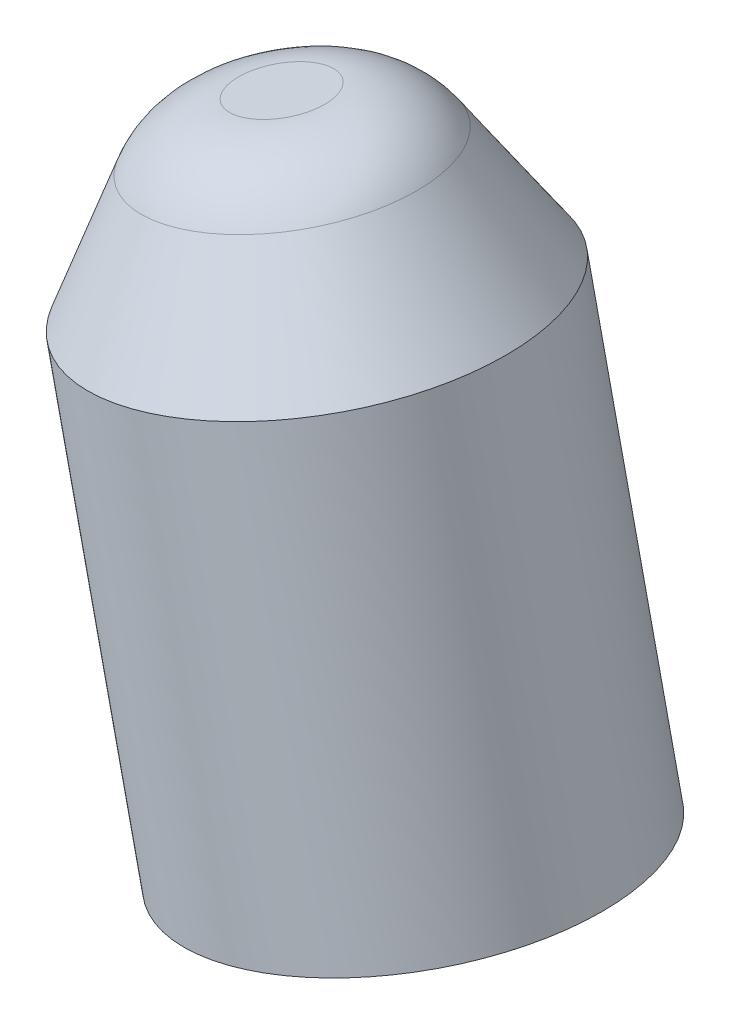
ISO-10303-21;
HEADER;
FILE_DESCRIPTION(('STEP AP214'),'2;1');
FILE_NAME('part.step','',(''),(''),'','','');
FILE_SCHEMA(('AUTOMOTIVE_DESIGN { 1 0 10303 214 1 1 1 1 }'));
ENDSEC;
DATA;
#1=APPLICATION_CONTEXT('core data for automotive mechanical design processes');
#2=APPLICATION_PROTOCOL_DEFINITION('international standard','automotive_design',2000,#1);
#3=PRODUCT_CONTEXT('',#1,'mechanical');
#4=PRODUCT('Part','Part','',(#3));
#5=PRODUCT_RELATED_PRODUCT_CATEGORY('part','',(#4));
#6=PRODUCT_DEFINITION_FORMATION('','',#4);
#7=PRODUCT_DEFINITION_CONTEXT('part definition',#1,'design');
#8=PRODUCT_DEFINITION('design','',#6,#7);
#9=PRODUCT_DEFINITION_SHAPE('','',#8);
#10=(LENGTH_UNIT() NAMED_UNIT(*) SI_UNIT(.MILLI.,.METRE.));
#11=(NAMED_UNIT(*) PLANE_ANGLE_UNIT() SI_UNIT($,.RADIAN.));
#12=(NAMED_UNIT(*) SI_UNIT($,.STERADIAN.) SOLID_ANGLE_UNIT());
#13=UNCERTAINTY_MEASURE_WITH_UNIT(LENGTH_MEASURE(1.E-05),#10,'distance_accuracy_value','');
#14=(GEOMETRIC_REPRESENTATION_CONTEXT(3) GLOBAL_UNCERTAINTY_ASSIGNED_CONTEXT((#13)) GLOBAL_UNIT_ASSIGNED_CONTEXT((#10,
#11,#12)) REPRESENTATION_CONTEXT('',''));
#15=CARTESIAN_POINT('',(0.,0.,0.));
#16=DIRECTION('',(0.,0.,1.));
#17=DIRECTION('',(1.,0.,0.));
#18=AXIS2_PLACEMENT_3D('',#15,#16,#17);
#19=CARTESIAN_POINT('',(-4.13806406644025,14.8556007731905,0.));
#20=DIRECTION('',(0.216439613938103,-0.976296007119933,0.));
#21=DIRECTION('',(0.976296007119933,0.216439613938103,0.));
#22=AXIS2_PLACEMENT_3D('',#19,#20,#21);
#23=PLANE('',#22);
#24=CARTESIAN_POINT('',(-4.13806406644025,14.8556007731905,0.));
#25=DIRECTION('',(0.216439613938106,-0.976296007119933,0.));
#26=DIRECTION('',(0.976296007119933,0.216439613938106,0.));
#27=AXIS2_PLACEMENT_3D('',#24,#25,#26);
#28=CIRCLE('',#27,0.580740066778151);
#29=CARTESIAN_POINT('',(-3.57108985807018,14.9812959290423,0.));
#30=VERTEX_POINT('',#29);
#31=EDGE_CURVE('E19',#30,#30,#28,.T.);
#32=ORIENTED_EDGE('',*,*,#31,.F.);
#33=EDGE_LOOP('',(#32));
#34=FACE_BOUND('',#33,.T.);
#35=ADVANCED_FACE('F15',(#34),#23,.F.);
#36=CARTESIAN_POINT('',(-3.86318575673886,13.6157048441481,0.));
#37=DIRECTION('',(0.216439613938106,-0.976296007119933,0.));
#38=DIRECTION('',(0.976296007119933,0.216439613938106,0.));
#39=AXIS2_PLACEMENT_3D('',#36,#37,#38);
#40=DEGENERATE_TOROIDAL_SURFACE('',#39,0.58074006677815,1.27000000000002,.T.);
#41=CARTESIAN_POINT('',(-4.00062491159158,14.2356528086784,0.));
#42=DIRECTION('',(0.216439613938103,-0.976296007119933,0.));
#43=DIRECTION('',(0.976296007119933,0.216439613938103,0.));
#44=AXIS2_PLACEMENT_3D('',#41,#42,#43);
#45=CIRCLE('',#44,1.6805923295735);
#46=CARTESIAN_POINT('',(-2.35986933063259,14.5993995636786,0.));
#47=VERTEX_POINT('',#46);
#48=EDGE_CURVE('E28',#47,#47,#45,.T.);
#49=ORIENTED_EDGE('',*,*,#48,.F.);
#50=EDGE_LOOP('',(#49));
#51=FACE_BOUND('',#50,.T.);
#52=ORIENTED_EDGE('',*,*,#31,.T.);
#53=EDGE_LOOP('',(#52));
#54=FACE_BOUND('',#53,.T.);
#55=ADVANCED_FACE('F17',(#51,#54),#40,.T.);
#56=CARTESIAN_POINT('',(0.0858601020535581,7.59676182272367,0.));
#57=DIRECTION('',(-0.216439613938103,0.976296007119933,0.));
#58=DIRECTION('',(-0.976296007119933,-0.216439613938103,0.));
#59=AXIS2_PLACEMENT_3D('',#56,#57,#58);
#60=PLANE('',#59);
#61=CARTESIAN_POINT('',(-2.40633071532149,7.04425642022387,0.));
#62=DIRECTION('',(-0.216439613938103,0.976296007119933,0.));
#63=DIRECTION('',(-0.976296007119933,-0.216439613938103,0.));
#64=AXIS2_PLACEMENT_3D('',#61,#62,#63);
#65=CIRCLE('',#64,2.5527);
#66=CARTESIAN_POINT('',(-4.89852153269655,6.49175101772407,0.));
#67=VERTEX_POINT('',#66);
#68=EDGE_CURVE('E23',#67,#67,#65,.T.);
#69=ORIENTED_EDGE('',*,*,#68,.F.);
#70=EDGE_LOOP('',(#69));
#71=FACE_BOUND('',#70,.T.);
#72=ADVANCED_FACE('F46',(#71),#60,.F.);
#73=CARTESIAN_POINT('',(-3.67368534377572,12.7609237199478,0.));
#74=DIRECTION('',(0.216439613938102,-0.976296007119934,0.));
#75=DIRECTION('',(0.976296007119934,0.216439613938102,0.));
#76=AXIS2_PLACEMENT_3D('',#73,#74,#75);
#77=CONICAL_SURFACE('',#76,2.55269999993594,0.523598775598828);
#78=ORIENTED_EDGE('',*,*,#48,.T.);
#79=EDGE_LOOP('',(#78));
#80=FACE_BOUND('',#79,.T.);
#81=CARTESIAN_POINT('',(-3.6736853437564,12.7609237198607,0.));
#82=DIRECTION('',(-0.216439613938103,0.976296007119933,0.));
#83=DIRECTION('',(-0.976296007119933,-0.216439613938103,0.));
#84=AXIS2_PLACEMENT_3D('',#81,#82,#83);
#85=CIRCLE('',#84,2.5527);
#86=CARTESIAN_POINT('',(-6.16587616113145,12.2084183173609,0.));
#87=VERTEX_POINT('',#86);
#88=EDGE_CURVE('E10',#87,#87,#85,.F.);
#89=ORIENTED_EDGE('',*,*,#88,.F.);
#90=EDGE_LOOP('',(#89));
#91=FACE_BOUND('',#90,.T.);
#92=ADVANCED_FACE('F51',(#80,#91),#77,.T.);
#93=CARTESIAN_POINT('',(-2.4063307153215,7.04425642022388,0.));
#94=DIRECTION('',(-0.216439613938103,0.976296007119933,0.));
#95=DIRECTION('',(-0.976296007119933,-0.216439613938103,0.));
#96=AXIS2_PLACEMENT_3D('',#93,#94,#95);
#97=CYLINDRICAL_SURFACE('',#96,2.5527);
#98=ORIENTED_EDGE('',*,*,#88,.T.);
#99=EDGE_LOOP('',(#98));
#100=FACE_BOUND('',#99,.T.);
#101=ORIENTED_EDGE('',*,*,#68,.T.);
#102=EDGE_LOOP('',(#101));
#103=FACE_BOUND('',#102,.T.);
#104=ADVANCED_FACE('F49',(#100,#103),#97,.T.);
#105=CLOSED_SHELL('',(#35,#55,#72,#92,#104));
#106=MANIFOLD_SOLID_BREP('B1',#105);
#107=ADVANCED_BREP_SHAPE_REPRESENTATION('',(#18,#106),#14);
#108=SHAPE_DEFINITION_REPRESENTATION(#9,#107);
ENDSEC;
END-ISO-10303-21;
